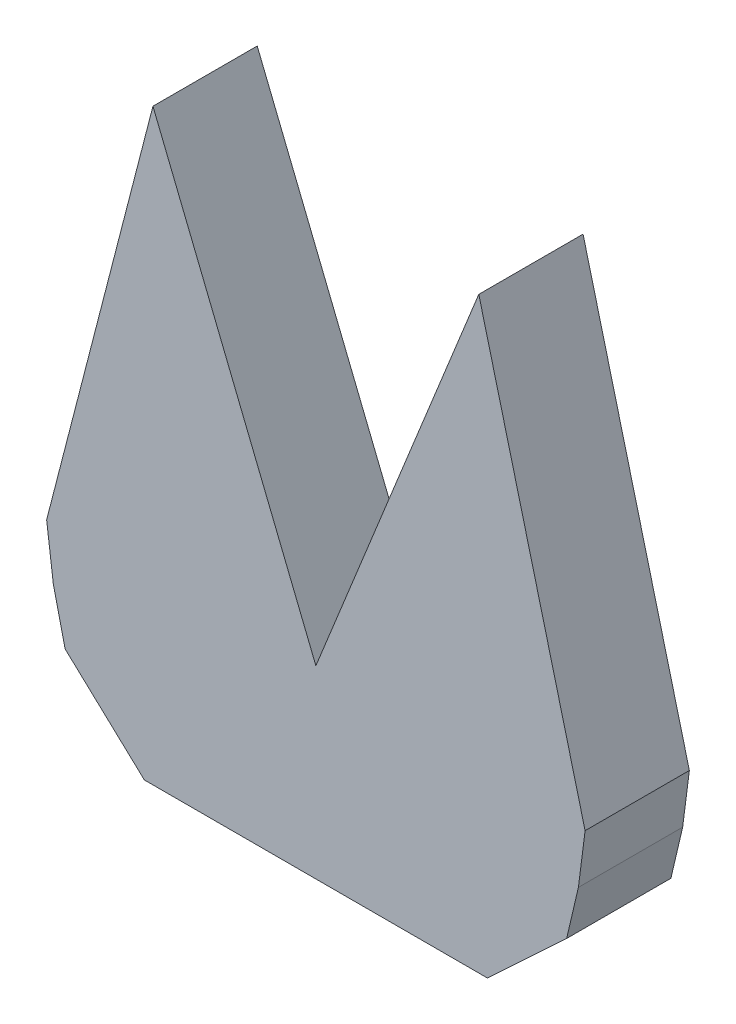
ISO-10303-21;
HEADER;
FILE_DESCRIPTION(('STEP AP214'),'2;1');
FILE_NAME('part.step','',(''),(''),'','','');
FILE_SCHEMA(('AUTOMOTIVE_DESIGN { 1 0 10303 214 1 1 1 1 }'));
ENDSEC;
DATA;
#1=APPLICATION_CONTEXT('core data for automotive mechanical design processes');
#2=APPLICATION_PROTOCOL_DEFINITION('international standard','automotive_design',2000,#1);
#3=PRODUCT_CONTEXT('',#1,'mechanical');
#4=PRODUCT('Part','Part','',(#3));
#5=PRODUCT_RELATED_PRODUCT_CATEGORY('part','',(#4));
#6=PRODUCT_DEFINITION_FORMATION('','',#4);
#7=PRODUCT_DEFINITION_CONTEXT('part definition',#1,'design');
#8=PRODUCT_DEFINITION('design','',#6,#7);
#9=PRODUCT_DEFINITION_SHAPE('','',#8);
#10=(LENGTH_UNIT() NAMED_UNIT(*) SI_UNIT(.MILLI.,.METRE.));
#11=(NAMED_UNIT(*) PLANE_ANGLE_UNIT() SI_UNIT($,.RADIAN.));
#12=(NAMED_UNIT(*) SI_UNIT($,.STERADIAN.) SOLID_ANGLE_UNIT());
#13=UNCERTAINTY_MEASURE_WITH_UNIT(LENGTH_MEASURE(1.E-05),#10,'distance_accuracy_value','');
#14=(GEOMETRIC_REPRESENTATION_CONTEXT(3) GLOBAL_UNCERTAINTY_ASSIGNED_CONTEXT((#13)) GLOBAL_UNIT_ASSIGNED_CONTEXT((#10,
#11,#12)) REPRESENTATION_CONTEXT('',''));
#15=CARTESIAN_POINT('',(0.,0.,0.));
#16=DIRECTION('',(0.,0.,1.));
#17=DIRECTION('',(1.,0.,0.));
#18=AXIS2_PLACEMENT_3D('',#15,#16,#17);
#19=CARTESIAN_POINT('',(57.724892119532,16.9964924899321,24.));
#20=DIRECTION('',(-0.973586431852192,0.228318767764099,0.));
#21=DIRECTION('',(-0.228318767764099,-0.973586431852192,0.));
#22=AXIS2_PLACEMENT_3D('',#19,#20,#21);
#23=PLANE('',#22);
#24=DIRECTION('',(0.228318767764099,0.973586431852192,0.));
#25=VECTOR('',#24,1.);
#26=CARTESIAN_POINT('',(57.724892119532,16.9964924899321,0.));
#27=LINE('',#26,#25);
#28=CARTESIAN_POINT('',(57.724892119532,16.9964924899321,0.));
#29=VERTEX_POINT('',#28);
#30=CARTESIAN_POINT('',(60.4332237708532,28.5452362682208,0.));
#31=VERTEX_POINT('',#30);
#32=EDGE_CURVE('E147',#29,#31,#27,.T.);
#33=ORIENTED_EDGE('',*,*,#32,.T.);
#34=DIRECTION('',(0.,0.,-1.));
#35=VECTOR('',#34,1.);
#36=CARTESIAN_POINT('',(60.4332237708532,28.5452362682208,24.));
#37=LINE('',#36,#35);
#38=CARTESIAN_POINT('',(60.4332237708532,28.5452362682208,24.));
#39=VERTEX_POINT('',#38);
#40=EDGE_CURVE('E11',#39,#31,#37,.T.);
#41=ORIENTED_EDGE('',*,*,#40,.F.);
#42=DIRECTION('',(0.228318767764099,0.973586431852192,0.));
#43=VECTOR('',#42,1.);
#44=CARTESIAN_POINT('',(57.724892119532,16.9964924899321,24.));
#45=LINE('',#44,#43);
#46=CARTESIAN_POINT('',(57.724892119532,16.9964924899321,24.));
#47=VERTEX_POINT('',#46);
#48=EDGE_CURVE('E167',#47,#39,#45,.T.);
#49=ORIENTED_EDGE('',*,*,#48,.F.);
#50=DIRECTION('',(0.,0.,-1.));
#51=VECTOR('',#50,1.);
#52=CARTESIAN_POINT('',(57.724892119532,16.9964924899321,24.));
#53=LINE('',#52,#51);
#54=EDGE_CURVE('E143',#47,#29,#53,.T.);
#55=ORIENTED_EDGE('',*,*,#54,.T.);
#56=EDGE_LOOP('',(#33,#41,#49,#55));
#57=FACE_BOUND('',#56,.T.);
#58=ADVANCED_FACE('F33',(#57),#23,.F.);
#59=CARTESIAN_POINT('',(60.4332237708532,28.5452362682208,24.));
#60=DIRECTION('',(-0.991943564744807,0.126680560313591,0.));
#61=DIRECTION('',(-0.126680560313591,-0.991943564744807,0.));
#62=AXIS2_PLACEMENT_3D('',#59,#60,#61);
#63=PLANE('',#62);
#64=DIRECTION('',(0.126680560313591,0.991943564744807,0.));
#65=VECTOR('',#64,1.);
#66=CARTESIAN_POINT('',(60.4332237708532,28.5452362682208,0.));
#67=LINE('',#66,#65);
#68=CARTESIAN_POINT('',(61.9749258872019,40.6171870811938,0.));
#69=VERTEX_POINT('',#68);
#70=EDGE_CURVE('E150',#31,#69,#67,.T.);
#71=ORIENTED_EDGE('',*,*,#70,.T.);
#72=DIRECTION('',(0.,0.,-1.));
#73=VECTOR('',#72,1.);
#74=CARTESIAN_POINT('',(61.9749258872019,40.6171870811938,24.));
#75=LINE('',#74,#73);
#76=CARTESIAN_POINT('',(61.9749258872019,40.6171870811938,24.));
#77=VERTEX_POINT('',#76);
#78=EDGE_CURVE('E41',#77,#69,#75,.T.);
#79=ORIENTED_EDGE('',*,*,#78,.F.);
#80=DIRECTION('',(0.126680560313591,0.991943564744807,0.));
#81=VECTOR('',#80,1.);
#82=CARTESIAN_POINT('',(60.4332237708532,28.5452362682208,24.));
#83=LINE('',#82,#81);
#84=EDGE_CURVE('E101',#39,#77,#83,.T.);
#85=ORIENTED_EDGE('',*,*,#84,.F.);
#86=ORIENTED_EDGE('',*,*,#40,.T.);
#87=EDGE_LOOP('',(#71,#79,#85,#86));
#88=FACE_BOUND('',#87,.T.);
#89=ADVANCED_FACE('F239',(#88),#63,.F.);
#90=CARTESIAN_POINT('',(61.9749258872019,40.6171870811938,24.));
#91=DIRECTION('',(-0.968191325186672,-0.250211026602097,0.));
#92=DIRECTION('',(0.250211026602097,-0.968191325186672,0.));
#93=AXIS2_PLACEMENT_3D('',#90,#91,#92);
#94=PLANE('',#93);
#95=DIRECTION('',(-0.250211026602097,0.968191325186672,0.));
#96=VECTOR('',#95,1.);
#97=CARTESIAN_POINT('',(61.9749258872019,40.6171870811938,0.));
#98=LINE('',#97,#96);
#99=CARTESIAN_POINT('',(37.5042874855168,135.30629868445,0.));
#100=VERTEX_POINT('',#99);
#101=EDGE_CURVE('E152',#69,#100,#98,.T.);
#102=ORIENTED_EDGE('',*,*,#101,.T.);
#103=DIRECTION('',(0.,0.,-1.));
#104=VECTOR('',#103,1.);
#105=CARTESIAN_POINT('',(37.5042874855168,135.30629868445,24.));
#106=LINE('',#105,#104);
#107=CARTESIAN_POINT('',(37.5042874855168,135.30629868445,24.));
#108=VERTEX_POINT('',#107);
#109=EDGE_CURVE('E183',#108,#100,#106,.T.);
#110=ORIENTED_EDGE('',*,*,#109,.F.);
#111=DIRECTION('',(-0.250211026602097,0.968191325186672,0.));
#112=VECTOR('',#111,1.);
#113=CARTESIAN_POINT('',(61.9749258872019,40.6171870811938,24.));
#114=LINE('',#113,#112);
#115=EDGE_CURVE('E191',#77,#108,#114,.T.);
#116=ORIENTED_EDGE('',*,*,#115,.F.);
#117=ORIENTED_EDGE('',*,*,#78,.T.);
#118=EDGE_LOOP('',(#102,#110,#116,#117));
#119=FACE_BOUND('',#118,.T.);
#120=ADVANCED_FACE('F189',(#119),#94,.F.);
#121=CARTESIAN_POINT('',(37.5042874855168,135.30629868445,24.));
#122=DIRECTION('',(0.927143831084226,-0.374705639779366,0.));
#123=DIRECTION('',(0.374705639779366,0.927143831084226,0.));
#124=AXIS2_PLACEMENT_3D('',#121,#122,#123);
#125=PLANE('',#124);
#126=DIRECTION('',(-0.374705639779366,-0.927143831084226,0.));
#127=VECTOR('',#126,1.);
#128=CARTESIAN_POINT('',(37.5042874855168,135.30629868445,0.));
#129=LINE('',#128,#127);
#130=CARTESIAN_POINT('',(0.,42.5084726312301,0.));
#131=VERTEX_POINT('',#130);
#132=EDGE_CURVE('E154',#100,#131,#129,.T.);
#133=ORIENTED_EDGE('',*,*,#132,.T.);
#134=DIRECTION('',(0.,0.,-1.));
#135=VECTOR('',#134,1.);
#136=CARTESIAN_POINT('',(0.,42.5084726312301,24.));
#137=LINE('',#136,#135);
#138=CARTESIAN_POINT('',(0.,42.5084726312301,24.));
#139=VERTEX_POINT('',#138);
#140=EDGE_CURVE('E180',#139,#131,#137,.T.);
#141=ORIENTED_EDGE('',*,*,#140,.F.);
#142=DIRECTION('',(-0.374705639779366,-0.927143831084226,0.));
#143=VECTOR('',#142,1.);
#144=CARTESIAN_POINT('',(37.5042874855168,135.30629868445,24.));
#145=LINE('',#144,#143);
#146=EDGE_CURVE('E209',#108,#139,#145,.T.);
#147=ORIENTED_EDGE('',*,*,#146,.F.);
#148=ORIENTED_EDGE('',*,*,#109,.T.);
#149=EDGE_LOOP('',(#133,#141,#147,#148));
#150=FACE_BOUND('',#149,.T.);
#151=ADVANCED_FACE('F200',(#150),#125,.F.);
#152=CARTESIAN_POINT('',(-37.5042874855168,135.30629868445,24.));
#153=DIRECTION('',(-0.927143831084226,-0.374705639779367,0.));
#154=DIRECTION('',(0.374705639779367,-0.927143831084226,0.));
#155=AXIS2_PLACEMENT_3D('',#152,#153,#154);
#156=PLANE('',#155);
#157=DIRECTION('',(-0.374705639779367,0.927143831084226,0.));
#158=VECTOR('',#157,1.);
#159=CARTESIAN_POINT('',(-37.5042874855168,135.30629868445,0.));
#160=LINE('',#159,#158);
#161=CARTESIAN_POINT('',(-37.5042874855168,135.30629868445,0.));
#162=VERTEX_POINT('',#161);
#163=EDGE_CURVE('E156',#131,#162,#160,.T.);
#164=ORIENTED_EDGE('',*,*,#163,.T.);
#165=DIRECTION('',(0.,0.,-1.));
#166=VECTOR('',#165,1.);
#167=CARTESIAN_POINT('',(-37.5042874855168,135.30629868445,24.));
#168=LINE('',#167,#166);
#169=CARTESIAN_POINT('',(-37.5042874855168,135.30629868445,24.));
#170=VERTEX_POINT('',#169);
#171=EDGE_CURVE('E177',#170,#162,#168,.T.);
#172=ORIENTED_EDGE('',*,*,#171,.F.);
#173=DIRECTION('',(-0.374705639779367,0.927143831084226,0.));
#174=VECTOR('',#173,1.);
#175=CARTESIAN_POINT('',(-37.5042874855168,135.30629868445,24.));
#176=LINE('',#175,#174);
#177=EDGE_CURVE('E206',#139,#170,#176,.T.);
#178=ORIENTED_EDGE('',*,*,#177,.F.);
#179=ORIENTED_EDGE('',*,*,#140,.T.);
#180=EDGE_LOOP('',(#164,#172,#178,#179));
#181=FACE_BOUND('',#180,.T.);
#182=ADVANCED_FACE('F204',(#181),#156,.F.);
#183=CARTESIAN_POINT('',(-61.9749258872019,40.6171870811938,24.));
#184=DIRECTION('',(0.968191325186672,-0.250211026602097,0.));
#185=DIRECTION('',(0.250211026602097,0.968191325186672,0.));
#186=AXIS2_PLACEMENT_3D('',#183,#184,#185);
#187=PLANE('',#186);
#188=DIRECTION('',(-0.250211026602097,-0.968191325186672,0.));
#189=VECTOR('',#188,1.);
#190=CARTESIAN_POINT('',(-61.9749258872019,40.6171870811938,0.));
#191=LINE('',#190,#189);
#192=CARTESIAN_POINT('',(-61.9749258872019,40.6171870811938,0.));
#193=VERTEX_POINT('',#192);
#194=EDGE_CURVE('E158',#162,#193,#191,.T.);
#195=ORIENTED_EDGE('',*,*,#194,.T.);
#196=DIRECTION('',(0.,0.,-1.));
#197=VECTOR('',#196,1.);
#198=CARTESIAN_POINT('',(-61.9749258872019,40.6171870811938,24.));
#199=LINE('',#198,#197);
#200=CARTESIAN_POINT('',(-61.9749258872019,40.6171870811938,24.));
#201=VERTEX_POINT('',#200);
#202=EDGE_CURVE('E174',#201,#193,#199,.T.);
#203=ORIENTED_EDGE('',*,*,#202,.F.);
#204=DIRECTION('',(-0.250211026602097,-0.968191325186672,0.));
#205=VECTOR('',#204,1.);
#206=CARTESIAN_POINT('',(-61.9749258872019,40.6171870811938,24.));
#207=LINE('',#206,#205);
#208=EDGE_CURVE('E208',#170,#201,#207,.T.);
#209=ORIENTED_EDGE('',*,*,#208,.F.);
#210=ORIENTED_EDGE('',*,*,#171,.T.);
#211=EDGE_LOOP('',(#195,#203,#209,#210));
#212=FACE_BOUND('',#211,.T.);
#213=ADVANCED_FACE('F252',(#212),#187,.F.);
#214=CARTESIAN_POINT('',(-60.4332237708532,28.5452362682208,24.));
#215=DIRECTION('',(0.991943564744807,0.126680560313591,0.));
#216=DIRECTION('',(-0.126680560313591,0.991943564744807,0.));
#217=AXIS2_PLACEMENT_3D('',#214,#215,#216);
#218=PLANE('',#217);
#219=DIRECTION('',(0.126680560313591,-0.991943564744807,0.));
#220=VECTOR('',#219,1.);
#221=CARTESIAN_POINT('',(-60.4332237708532,28.5452362682208,0.));
#222=LINE('',#221,#220);
#223=CARTESIAN_POINT('',(-60.4332237708532,28.5452362682208,0.));
#224=VERTEX_POINT('',#223);
#225=EDGE_CURVE('E160',#193,#224,#222,.T.);
#226=ORIENTED_EDGE('',*,*,#225,.T.);
#227=DIRECTION('',(0.,0.,-1.));
#228=VECTOR('',#227,1.);
#229=CARTESIAN_POINT('',(-60.4332237708532,28.5452362682208,24.));
#230=LINE('',#229,#228);
#231=CARTESIAN_POINT('',(-60.4332237708532,28.5452362682208,24.));
#232=VERTEX_POINT('',#231);
#233=EDGE_CURVE('E171',#232,#224,#230,.T.);
#234=ORIENTED_EDGE('',*,*,#233,.F.);
#235=DIRECTION('',(0.126680560313591,-0.991943564744807,0.));
#236=VECTOR('',#235,1.);
#237=CARTESIAN_POINT('',(-60.4332237708532,28.5452362682208,24.));
#238=LINE('',#237,#236);
#239=EDGE_CURVE('E211',#201,#232,#238,.T.);
#240=ORIENTED_EDGE('',*,*,#239,.F.);
#241=ORIENTED_EDGE('',*,*,#202,.T.);
#242=EDGE_LOOP('',(#226,#234,#240,#241));
#243=FACE_BOUND('',#242,.T.);
#244=ADVANCED_FACE('F220',(#243),#218,.F.);
#245=CARTESIAN_POINT('',(-57.724892119532,16.9964924899321,24.));
#246=DIRECTION('',(0.973586431852192,0.228318767764099,0.));
#247=DIRECTION('',(-0.228318767764099,0.973586431852192,0.));
#248=AXIS2_PLACEMENT_3D('',#245,#246,#247);
#249=PLANE('',#248);
#250=DIRECTION('',(0.228318767764099,-0.973586431852192,0.));
#251=VECTOR('',#250,1.);
#252=CARTESIAN_POINT('',(-57.724892119532,16.9964924899321,0.));
#253=LINE('',#252,#251);
#254=CARTESIAN_POINT('',(-57.724892119532,16.9964924899321,0.));
#255=VERTEX_POINT('',#254);
#256=EDGE_CURVE('E162',#224,#255,#253,.T.);
#257=ORIENTED_EDGE('',*,*,#256,.T.);
#258=DIRECTION('',(0.,0.,-1.));
#259=VECTOR('',#258,1.);
#260=CARTESIAN_POINT('',(-57.724892119532,16.9964924899321,24.));
#261=LINE('',#260,#259);
#262=CARTESIAN_POINT('',(-57.724892119532,16.9964924899321,24.));
#263=VERTEX_POINT('',#262);
#264=EDGE_CURVE('E138',#263,#255,#261,.T.);
#265=ORIENTED_EDGE('',*,*,#264,.F.);
#266=DIRECTION('',(0.228318767764099,-0.973586431852192,0.));
#267=VECTOR('',#266,1.);
#268=CARTESIAN_POINT('',(-57.724892119532,16.9964924899321,24.));
#269=LINE('',#268,#267);
#270=EDGE_CURVE('E129',#232,#263,#269,.T.);
#271=ORIENTED_EDGE('',*,*,#270,.F.);
#272=ORIENTED_EDGE('',*,*,#233,.T.);
#273=EDGE_LOOP('',(#257,#265,#271,#272));
#274=FACE_BOUND('',#273,.T.);
#275=ADVANCED_FACE('F224',(#274),#249,.F.);
#276=CARTESIAN_POINT('',(-39.48,0.,24.));
#277=DIRECTION('',(0.68163050626708,0.731696557956974,0.));
#278=DIRECTION('',(-0.731696557956974,0.68163050626708,0.));
#279=AXIS2_PLACEMENT_3D('',#276,#277,#278);
#280=PLANE('',#279);
#281=DIRECTION('',(0.731696557956974,-0.68163050626708,0.));
#282=VECTOR('',#281,1.);
#283=CARTESIAN_POINT('',(-39.48,0.,0.));
#284=LINE('',#283,#282);
#285=CARTESIAN_POINT('',(-39.48,0.,0.));
#286=VERTEX_POINT('',#285);
#287=EDGE_CURVE('E137',#255,#286,#284,.T.);
#288=ORIENTED_EDGE('',*,*,#287,.T.);
#289=DIRECTION('',(0.,0.,-1.));
#290=VECTOR('',#289,1.);
#291=CARTESIAN_POINT('',(-39.48,0.,24.));
#292=LINE('',#291,#290);
#293=CARTESIAN_POINT('',(-39.48,0.,24.));
#294=VERTEX_POINT('',#293);
#295=EDGE_CURVE('E134',#294,#286,#292,.T.);
#296=ORIENTED_EDGE('',*,*,#295,.F.);
#297=DIRECTION('',(0.731696557956974,-0.68163050626708,0.));
#298=VECTOR('',#297,1.);
#299=CARTESIAN_POINT('',(-39.48,0.,24.));
#300=LINE('',#299,#298);
#301=EDGE_CURVE('E123',#263,#294,#300,.T.);
#302=ORIENTED_EDGE('',*,*,#301,.F.);
#303=ORIENTED_EDGE('',*,*,#264,.T.);
#304=EDGE_LOOP('',(#288,#296,#302,#303));
#305=FACE_BOUND('',#304,.T.);
#306=ADVANCED_FACE('F135',(#305),#280,.F.);
#307=CARTESIAN_POINT('',(39.48,0.,24.));
#308=DIRECTION('',(0.,1.,0.));
#309=DIRECTION('',(0.,0.,1.));
#310=AXIS2_PLACEMENT_3D('',#307,#308,#309);
#311=PLANE('',#310);
#312=DIRECTION('',(1.,0.,0.));
#313=VECTOR('',#312,1.);
#314=CARTESIAN_POINT('',(39.48,0.,0.));
#315=LINE('',#314,#313);
#316=CARTESIAN_POINT('',(39.48,0.,0.));
#317=VERTEX_POINT('',#316);
#318=EDGE_CURVE('E87',#286,#317,#315,.T.);
#319=ORIENTED_EDGE('',*,*,#318,.T.);
#320=DIRECTION('',(0.,0.,-1.));
#321=VECTOR('',#320,1.);
#322=CARTESIAN_POINT('',(39.48,0.,24.));
#323=LINE('',#322,#321);
#324=CARTESIAN_POINT('',(39.48,0.,24.));
#325=VERTEX_POINT('',#324);
#326=EDGE_CURVE('E139',#325,#317,#323,.T.);
#327=ORIENTED_EDGE('',*,*,#326,.F.);
#328=DIRECTION('',(1.,0.,0.));
#329=VECTOR('',#328,1.);
#330=CARTESIAN_POINT('',(39.48,0.,24.));
#331=LINE('',#330,#329);
#332=EDGE_CURVE('E127',#294,#325,#331,.T.);
#333=ORIENTED_EDGE('',*,*,#332,.F.);
#334=ORIENTED_EDGE('',*,*,#295,.T.);
#335=EDGE_LOOP('',(#319,#327,#333,#334));
#336=FACE_BOUND('',#335,.T.);
#337=ADVANCED_FACE('F141',(#336),#311,.F.);
#338=CARTESIAN_POINT('',(39.48,0.,24.));
#339=DIRECTION('',(-0.68163050626708,0.731696557956974,0.));
#340=DIRECTION('',(-0.731696557956974,-0.68163050626708,0.));
#341=AXIS2_PLACEMENT_3D('',#338,#339,#340);
#342=PLANE('',#341);
#343=DIRECTION('',(0.731696557956974,0.68163050626708,0.));
#344=VECTOR('',#343,1.);
#345=CARTESIAN_POINT('',(39.48,0.,0.));
#346=LINE('',#345,#344);
#347=EDGE_CURVE('E93',#317,#29,#346,.T.);
#348=ORIENTED_EDGE('',*,*,#347,.T.);
#349=ORIENTED_EDGE('',*,*,#54,.F.);
#350=DIRECTION('',(0.731696557956974,0.68163050626708,0.));
#351=VECTOR('',#350,1.);
#352=CARTESIAN_POINT('',(39.48,0.,24.));
#353=LINE('',#352,#351);
#354=EDGE_CURVE('E49',#325,#47,#353,.T.);
#355=ORIENTED_EDGE('',*,*,#354,.F.);
#356=ORIENTED_EDGE('',*,*,#326,.T.);
#357=EDGE_LOOP('',(#348,#349,#355,#356));
#358=FACE_BOUND('',#357,.T.);
#359=ADVANCED_FACE('F228',(#358),#342,.F.);
#360=CARTESIAN_POINT('',(0.,0.,24.));
#361=DIRECTION('',(0.,0.,1.));
#362=DIRECTION('',(1.,0.,0.));
#363=AXIS2_PLACEMENT_3D('',#360,#361,#362);
#364=PLANE('',#363);
#365=ORIENTED_EDGE('',*,*,#48,.T.);
#366=ORIENTED_EDGE('',*,*,#84,.T.);
#367=ORIENTED_EDGE('',*,*,#115,.T.);
#368=ORIENTED_EDGE('',*,*,#146,.T.);
#369=ORIENTED_EDGE('',*,*,#177,.T.);
#370=ORIENTED_EDGE('',*,*,#208,.T.);
#371=ORIENTED_EDGE('',*,*,#239,.T.);
#372=ORIENTED_EDGE('',*,*,#270,.T.);
#373=ORIENTED_EDGE('',*,*,#301,.T.);
#374=ORIENTED_EDGE('',*,*,#332,.T.);
#375=ORIENTED_EDGE('',*,*,#354,.T.);
#376=EDGE_LOOP('',(#365,#366,#367,#368,#369,#370,#371,#372,#373,#374,#375));
#377=FACE_BOUND('',#376,.T.);
#378=ADVANCED_FACE('F125',(#377),#364,.T.);
#379=CARTESIAN_POINT('',(0.,0.,0.));
#380=DIRECTION('',(0.,0.,1.));
#381=DIRECTION('',(1.,0.,0.));
#382=AXIS2_PLACEMENT_3D('',#379,#380,#381);
#383=PLANE('',#382);
#384=ORIENTED_EDGE('',*,*,#32,.F.);
#385=ORIENTED_EDGE('',*,*,#347,.F.);
#386=ORIENTED_EDGE('',*,*,#318,.F.);
#387=ORIENTED_EDGE('',*,*,#287,.F.);
#388=ORIENTED_EDGE('',*,*,#256,.F.);
#389=ORIENTED_EDGE('',*,*,#225,.F.);
#390=ORIENTED_EDGE('',*,*,#194,.F.);
#391=ORIENTED_EDGE('',*,*,#163,.F.);
#392=ORIENTED_EDGE('',*,*,#132,.F.);
#393=ORIENTED_EDGE('',*,*,#101,.F.);
#394=ORIENTED_EDGE('',*,*,#70,.F.);
#395=EDGE_LOOP('',(#384,#385,#386,#387,#388,#389,#390,#391,#392,#393,#394));
#396=FACE_BOUND('',#395,.T.);
#397=ADVANCED_FACE('F195',(#396),#383,.F.);
#398=CLOSED_SHELL('',(#58,#89,#120,#151,#182,#213,#244,#275,#306,#337,#359,#378,#397));
#399=MANIFOLD_SOLID_BREP('B2',#398);
#400=ADVANCED_BREP_SHAPE_REPRESENTATION('',(#18,#399),#14);
#401=SHAPE_DEFINITION_REPRESENTATION(#9,#400);
ENDSEC;
END-ISO-10303-21;
